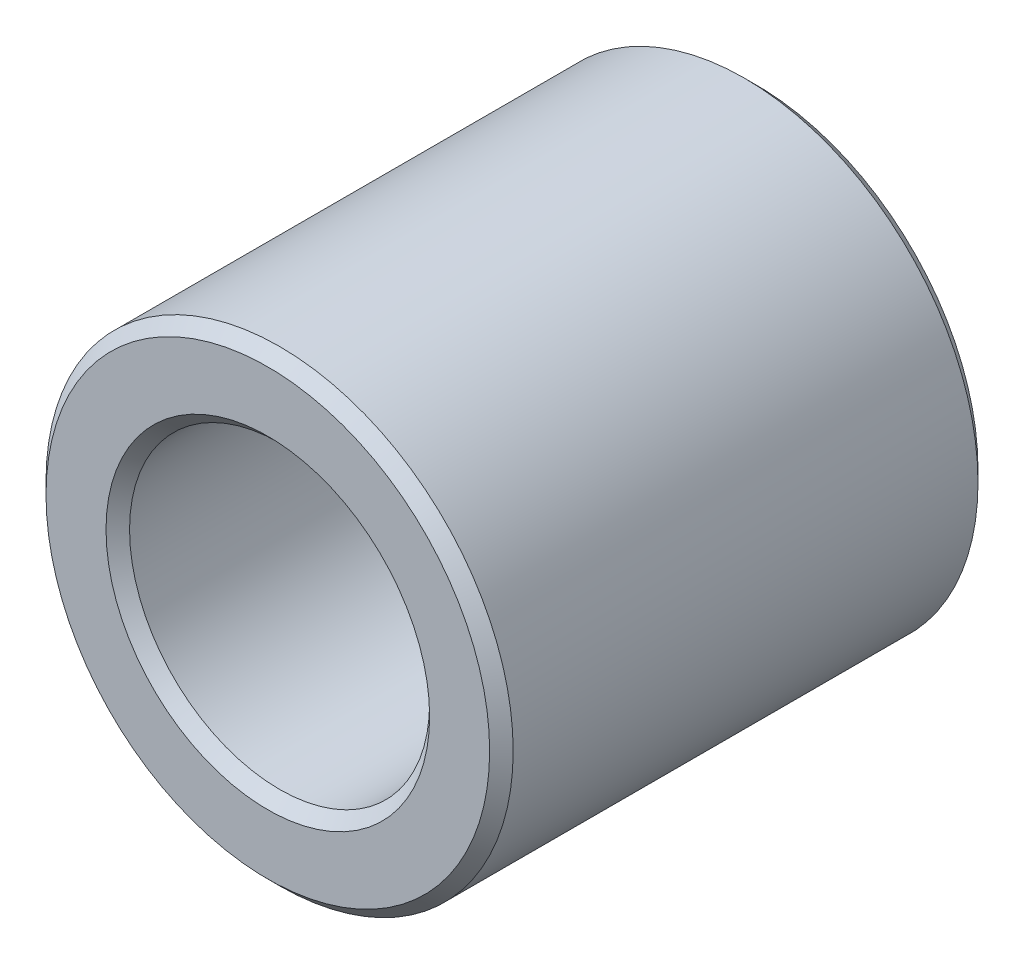
ISO-10303-21;
HEADER;
FILE_DESCRIPTION(('STEP AP214'),'2;1');
FILE_NAME('part.step','',(''),(''),'','','');
FILE_SCHEMA(('AUTOMOTIVE_DESIGN { 1 0 10303 214 1 1 1 1 }'));
ENDSEC;
DATA;
#1=APPLICATION_CONTEXT('core data for automotive mechanical design processes');
#2=APPLICATION_PROTOCOL_DEFINITION('international standard','automotive_design',2000,#1);
#3=PRODUCT_CONTEXT('',#1,'mechanical');
#4=PRODUCT('Part','Part','',(#3));
#5=PRODUCT_RELATED_PRODUCT_CATEGORY('part','',(#4));
#6=PRODUCT_DEFINITION_FORMATION('','',#4);
#7=PRODUCT_DEFINITION_CONTEXT('part definition',#1,'design');
#8=PRODUCT_DEFINITION('design','',#6,#7);
#9=PRODUCT_DEFINITION_SHAPE('','',#8);
#10=(LENGTH_UNIT() NAMED_UNIT(*) SI_UNIT(.MILLI.,.METRE.));
#11=(NAMED_UNIT(*) PLANE_ANGLE_UNIT() SI_UNIT($,.RADIAN.));
#12=(NAMED_UNIT(*) SI_UNIT($,.STERADIAN.) SOLID_ANGLE_UNIT());
#13=UNCERTAINTY_MEASURE_WITH_UNIT(LENGTH_MEASURE(1.E-05),#10,'distance_accuracy_value','');
#14=(GEOMETRIC_REPRESENTATION_CONTEXT(3) GLOBAL_UNCERTAINTY_ASSIGNED_CONTEXT((#13)) GLOBAL_UNIT_ASSIGNED_CONTEXT((#10,
#11,#12)) REPRESENTATION_CONTEXT('',''));
#15=CARTESIAN_POINT('',(0.,0.,0.));
#16=DIRECTION('',(0.,0.,1.));
#17=DIRECTION('',(1.,0.,0.));
#18=AXIS2_PLACEMENT_3D('',#15,#16,#17);
#19=CARTESIAN_POINT('',(0.,0.,8.3));
#20=DIRECTION('',(0.,0.,1.));
#21=DIRECTION('',(1.,0.,0.));
#22=AXIS2_PLACEMENT_3D('',#19,#20,#21);
#23=PLANE('',#22);
#24=CARTESIAN_POINT('',(0.,0.,8.3));
#25=DIRECTION('',(0.,0.,1.));
#26=DIRECTION('',(1.,0.,0.));
#27=AXIS2_PLACEMENT_3D('',#24,#25,#26);
#28=CIRCLE('',#27,2.75000000000001);
#29=CARTESIAN_POINT('',(2.75000000000001,0.,8.3));
#30=VERTEX_POINT('',#29);
#31=EDGE_CURVE('E10',#30,#30,#28,.F.);
#32=ORIENTED_EDGE('',*,*,#31,.T.);
#33=EDGE_LOOP('',(#32));
#34=FACE_BOUND('',#33,.T.);
#35=CARTESIAN_POINT('',(0.,0.,8.3));
#36=DIRECTION('',(0.,0.,1.));
#37=DIRECTION('',(1.,0.,0.));
#38=AXIS2_PLACEMENT_3D('',#35,#36,#37);
#39=CIRCLE('',#38,3.77000000000001);
#40=CARTESIAN_POINT('',(3.77000000000001,0.,8.3));
#41=VERTEX_POINT('',#40);
#42=EDGE_CURVE('E41',#41,#41,#39,.T.);
#43=ORIENTED_EDGE('',*,*,#42,.T.);
#44=EDGE_LOOP('',(#43));
#45=FACE_BOUND('',#44,.T.);
#46=ADVANCED_FACE('F34',(#34,#45),#23,.T.);
#47=CARTESIAN_POINT('',(0.,0.,0.));
#48=DIRECTION('',(0.,0.,1.));
#49=DIRECTION('',(1.,0.,0.));
#50=AXIS2_PLACEMENT_3D('',#47,#48,#49);
#51=PLANE('',#50);
#52=CARTESIAN_POINT('',(0.,0.,0.));
#53=DIRECTION('',(0.,0.,1.));
#54=DIRECTION('',(1.,0.,0.));
#55=AXIS2_PLACEMENT_3D('',#52,#53,#54);
#56=CIRCLE('',#55,3.76999999999999);
#57=CARTESIAN_POINT('',(3.76999999999999,0.,0.));
#58=VERTEX_POINT('',#57);
#59=EDGE_CURVE('E54',#58,#58,#56,.F.);
#60=ORIENTED_EDGE('',*,*,#59,.T.);
#61=EDGE_LOOP('',(#60));
#62=FACE_BOUND('',#61,.T.);
#63=CARTESIAN_POINT('',(0.,0.,0.));
#64=DIRECTION('',(0.,0.,1.));
#65=DIRECTION('',(1.,0.,0.));
#66=AXIS2_PLACEMENT_3D('',#63,#64,#65);
#67=CIRCLE('',#66,2.75);
#68=CARTESIAN_POINT('',(2.75,0.,0.));
#69=VERTEX_POINT('',#68);
#70=EDGE_CURVE('E57',#69,#69,#67,.T.);
#71=ORIENTED_EDGE('',*,*,#70,.T.);
#72=EDGE_LOOP('',(#71));
#73=FACE_BOUND('',#72,.T.);
#74=ADVANCED_FACE('F78',(#62,#73),#51,.F.);
#75=CARTESIAN_POINT('',(0.,0.,8.3));
#76=DIRECTION('',(0.,0.,-1.));
#77=DIRECTION('',(-1.,0.,0.));
#78=AXIS2_PLACEMENT_3D('',#75,#76,#77);
#79=CYLINDRICAL_SURFACE('',#78,3.97);
#80=CARTESIAN_POINT('',(0.,0.,0.200000000000006));
#81=DIRECTION('',(0.,0.,1.));
#82=DIRECTION('',(1.,0.,0.));
#83=AXIS2_PLACEMENT_3D('',#80,#81,#82);
#84=CIRCLE('',#83,3.97);
#85=CARTESIAN_POINT('',(3.97,0.,0.200000000000006));
#86=VERTEX_POINT('',#85);
#87=EDGE_CURVE('E60',#86,#86,#84,.T.);
#88=ORIENTED_EDGE('',*,*,#87,.T.);
#89=EDGE_LOOP('',(#88));
#90=FACE_BOUND('',#89,.T.);
#91=CARTESIAN_POINT('',(0.,0.,8.10000000000001));
#92=DIRECTION('',(0.,0.,1.));
#93=DIRECTION('',(1.,0.,0.));
#94=AXIS2_PLACEMENT_3D('',#91,#92,#93);
#95=CIRCLE('',#94,3.97);
#96=CARTESIAN_POINT('',(3.97,0.,8.10000000000001));
#97=VERTEX_POINT('',#96);
#98=EDGE_CURVE('E63',#97,#97,#95,.F.);
#99=ORIENTED_EDGE('',*,*,#98,.T.);
#100=EDGE_LOOP('',(#99));
#101=FACE_BOUND('',#100,.T.);
#102=ADVANCED_FACE('F67',(#90,#101),#79,.T.);
#103=CARTESIAN_POINT('',(0.,0.,8.3));
#104=DIRECTION('',(0.,0.,-1.));
#105=DIRECTION('',(-1.,0.,0.));
#106=AXIS2_PLACEMENT_3D('',#103,#104,#105);
#107=CYLINDRICAL_SURFACE('',#106,2.55);
#108=CARTESIAN_POINT('',(0.,0.,0.199999999999997));
#109=DIRECTION('',(0.,0.,1.));
#110=DIRECTION('',(1.,0.,0.));
#111=AXIS2_PLACEMENT_3D('',#108,#109,#110);
#112=CIRCLE('',#111,2.55);
#113=CARTESIAN_POINT('',(2.55,0.,0.199999999999997));
#114=VERTEX_POINT('',#113);
#115=EDGE_CURVE('E45',#114,#114,#112,.F.);
#116=ORIENTED_EDGE('',*,*,#115,.T.);
#117=EDGE_LOOP('',(#116));
#118=FACE_BOUND('',#117,.T.);
#119=CARTESIAN_POINT('',(0.,0.,8.09999999999999));
#120=DIRECTION('',(0.,0.,1.));
#121=DIRECTION('',(1.,0.,0.));
#122=AXIS2_PLACEMENT_3D('',#119,#120,#121);
#123=CIRCLE('',#122,2.55);
#124=CARTESIAN_POINT('',(2.55,0.,8.09999999999999));
#125=VERTEX_POINT('',#124);
#126=EDGE_CURVE('E49',#125,#125,#123,.T.);
#127=ORIENTED_EDGE('',*,*,#126,.T.);
#128=EDGE_LOOP('',(#127));
#129=FACE_BOUND('',#128,.T.);
#130=ADVANCED_FACE('F86',(#118,#129),#107,.F.);
#131=CARTESIAN_POINT('',(0.,0.,0.200000000000006));
#132=DIRECTION('',(0.,0.,1.));
#133=DIRECTION('',(1.,0.,0.));
#134=AXIS2_PLACEMENT_3D('',#131,#132,#133);
#135=CONICAL_SURFACE('',#134,3.97,0.785398163397448);
#136=ORIENTED_EDGE('',*,*,#59,.F.);
#137=EDGE_LOOP('',(#136));
#138=FACE_BOUND('',#137,.T.);
#139=ORIENTED_EDGE('',*,*,#87,.F.);
#140=EDGE_LOOP('',(#139));
#141=FACE_BOUND('',#140,.T.);
#142=ADVANCED_FACE('F91',(#138,#141),#135,.T.);
#143=CARTESIAN_POINT('',(0.,0.,0.));
#144=DIRECTION('',(0.,0.,-1.));
#145=DIRECTION('',(-1.,0.,0.));
#146=AXIS2_PLACEMENT_3D('',#143,#144,#145);
#147=CONICAL_SURFACE('',#146,2.75,0.785398163397446);
#148=ORIENTED_EDGE('',*,*,#115,.F.);
#149=EDGE_LOOP('',(#148));
#150=FACE_BOUND('',#149,.T.);
#151=ORIENTED_EDGE('',*,*,#70,.F.);
#152=EDGE_LOOP('',(#151));
#153=FACE_BOUND('',#152,.T.);
#154=ADVANCED_FACE('F75',(#150,#153),#147,.F.);
#155=CARTESIAN_POINT('',(0.,0.,8.09999999999999));
#156=DIRECTION('',(0.,0.,1.));
#157=DIRECTION('',(1.,0.,0.));
#158=AXIS2_PLACEMENT_3D('',#155,#156,#157);
#159=CONICAL_SURFACE('',#158,2.55,0.785398163397448);
#160=ORIENTED_EDGE('',*,*,#31,.F.);
#161=EDGE_LOOP('',(#160));
#162=FACE_BOUND('',#161,.T.);
#163=ORIENTED_EDGE('',*,*,#126,.F.);
#164=EDGE_LOOP('',(#163));
#165=FACE_BOUND('',#164,.T.);
#166=ADVANCED_FACE('F71',(#162,#165),#159,.F.);
#167=CARTESIAN_POINT('',(0.,0.,8.3));
#168=DIRECTION('',(0.,0.,-1.));
#169=DIRECTION('',(-1.,0.,0.));
#170=AXIS2_PLACEMENT_3D('',#167,#168,#169);
#171=CONICAL_SURFACE('',#170,3.77000000000001,0.785398163397444);
#172=ORIENTED_EDGE('',*,*,#98,.F.);
#173=EDGE_LOOP('',(#172));
#174=FACE_BOUND('',#173,.T.);
#175=ORIENTED_EDGE('',*,*,#42,.F.);
#176=EDGE_LOOP('',(#175));
#177=FACE_BOUND('',#176,.T.);
#178=ADVANCED_FACE('F36',(#174,#177),#171,.T.);
#179=CLOSED_SHELL('',(#46,#74,#102,#130,#142,#154,#166,#178));
#180=MANIFOLD_SOLID_BREP('B2',#179);
#181=ADVANCED_BREP_SHAPE_REPRESENTATION('',(#18,#180),#14);
#182=SHAPE_DEFINITION_REPRESENTATION(#9,#181);
ENDSEC;
END-ISO-10303-21;
